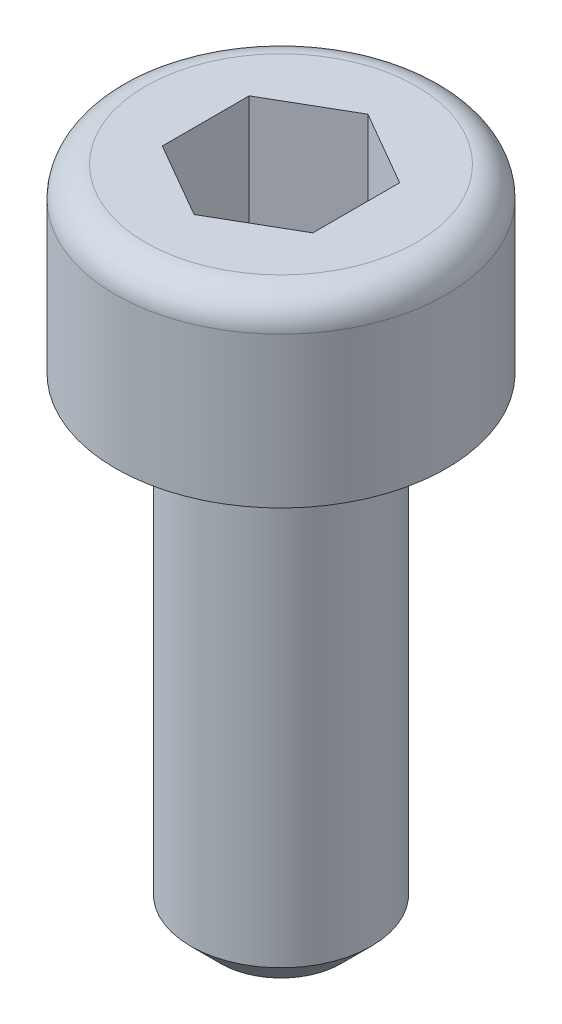
ISO-10303-21;
HEADER;
FILE_DESCRIPTION(('STEP AP214'),'2;1');
FILE_NAME('part.step','',(''),(''),'','','');
FILE_SCHEMA(('AUTOMOTIVE_DESIGN { 1 0 10303 214 1 1 1 1 }'));
ENDSEC;
DATA;
#1=APPLICATION_CONTEXT('core data for automotive mechanical design processes');
#2=APPLICATION_PROTOCOL_DEFINITION('international standard','automotive_design',2000,#1);
#3=PRODUCT_CONTEXT('',#1,'mechanical');
#4=PRODUCT('Part','Part','',(#3));
#5=PRODUCT_RELATED_PRODUCT_CATEGORY('part','',(#4));
#6=PRODUCT_DEFINITION_FORMATION('','',#4);
#7=PRODUCT_DEFINITION_CONTEXT('part definition',#1,'design');
#8=PRODUCT_DEFINITION('design','',#6,#7);
#9=PRODUCT_DEFINITION_SHAPE('','',#8);
#10=(LENGTH_UNIT() NAMED_UNIT(*) SI_UNIT(.MILLI.,.METRE.));
#11=(NAMED_UNIT(*) PLANE_ANGLE_UNIT() SI_UNIT($,.RADIAN.));
#12=(NAMED_UNIT(*) SI_UNIT($,.STERADIAN.) SOLID_ANGLE_UNIT());
#13=UNCERTAINTY_MEASURE_WITH_UNIT(LENGTH_MEASURE(1.E-05),#10,'distance_accuracy_value','');
#14=(GEOMETRIC_REPRESENTATION_CONTEXT(3) GLOBAL_UNCERTAINTY_ASSIGNED_CONTEXT((#13)) GLOBAL_UNIT_ASSIGNED_CONTEXT((#10,
#11,#12)) REPRESENTATION_CONTEXT('',''));
#15=CARTESIAN_POINT('',(0.,0.,0.));
#16=DIRECTION('',(0.,0.,1.));
#17=DIRECTION('',(1.,0.,0.));
#18=AXIS2_PLACEMENT_3D('',#15,#16,#17);
#19=CARTESIAN_POINT('',(0.,0.,0.));
#20=DIRECTION('',(0.,-1.,0.));
#21=DIRECTION('',(0.,0.,-1.));
#22=AXIS2_PLACEMENT_3D('',#19,#20,#21);
#23=PLANE('',#22);
#24=CARTESIAN_POINT('',(0.,0.,0.));
#25=DIRECTION('',(0.,-1.,0.));
#26=DIRECTION('',(0.,0.,-1.));
#27=AXIS2_PLACEMENT_3D('',#24,#25,#26);
#28=CIRCLE('',#27,2.25);
#29=CARTESIAN_POINT('',(0.,0.,-2.25));
#30=VERTEX_POINT('',#29);
#31=EDGE_CURVE('E42',#30,#30,#28,.F.);
#32=ORIENTED_EDGE('',*,*,#31,.T.);
#33=EDGE_LOOP('',(#32));
#34=FACE_BOUND('',#33,.T.);
#35=DIRECTION('',(-0.866025403784439,0.,-0.5));
#36=VECTOR('',#35,1.);
#37=CARTESIAN_POINT('',(1.25,0.,-0.721687836487032));
#38=LINE('',#37,#36);
#39=CARTESIAN_POINT('',(1.25,0.,-0.721687836487032));
#40=VERTEX_POINT('',#39);
#41=CARTESIAN_POINT('',(0.,0.,-1.44337567297406));
#42=VERTEX_POINT('',#41);
#43=EDGE_CURVE('E123',#40,#42,#38,.T.);
#44=ORIENTED_EDGE('',*,*,#43,.F.);
#45=DIRECTION('',(0.,0.,-1.));
#46=VECTOR('',#45,1.);
#47=CARTESIAN_POINT('',(1.25,0.,0.721687836487033));
#48=LINE('',#47,#46);
#49=CARTESIAN_POINT('',(1.25,0.,0.721687836487033));
#50=VERTEX_POINT('',#49);
#51=EDGE_CURVE('E49',#50,#40,#48,.T.);
#52=ORIENTED_EDGE('',*,*,#51,.F.);
#53=DIRECTION('',(0.866025403784439,0.,-0.5));
#54=VECTOR('',#53,1.);
#55=CARTESIAN_POINT('',(0.,0.,1.44337567297406));
#56=LINE('',#55,#54);
#57=CARTESIAN_POINT('',(0.,0.,1.44337567297406));
#58=VERTEX_POINT('',#57);
#59=EDGE_CURVE('E132',#58,#50,#56,.T.);
#60=ORIENTED_EDGE('',*,*,#59,.F.);
#61=DIRECTION('',(0.866025403784439,0.,0.5));
#62=VECTOR('',#61,1.);
#63=CARTESIAN_POINT('',(-1.25,0.,0.721687836487031));
#64=LINE('',#63,#62);
#65=CARTESIAN_POINT('',(-1.25,0.,0.721687836487031));
#66=VERTEX_POINT('',#65);
#67=EDGE_CURVE('E130',#66,#58,#64,.T.);
#68=ORIENTED_EDGE('',*,*,#67,.F.);
#69=DIRECTION('',(0.,0.,1.));
#70=VECTOR('',#69,1.);
#71=CARTESIAN_POINT('',(-1.25,0.,-0.721687836487033));
#72=LINE('',#71,#70);
#73=CARTESIAN_POINT('',(-1.25,0.,-0.721687836487033));
#74=VERTEX_POINT('',#73);
#75=EDGE_CURVE('E97',#74,#66,#72,.T.);
#76=ORIENTED_EDGE('',*,*,#75,.F.);
#77=DIRECTION('',(-0.866025403784439,0.,0.5));
#78=VECTOR('',#77,1.);
#79=CARTESIAN_POINT('',(0.,0.,-1.44337567297406));
#80=LINE('',#79,#78);
#81=EDGE_CURVE('E126',#42,#74,#80,.T.);
#82=ORIENTED_EDGE('',*,*,#81,.F.);
#83=EDGE_LOOP('',(#44,#52,#60,#68,#76,#82));
#84=FACE_BOUND('',#83,.T.);
#85=ADVANCED_FACE('F34',(#34,#84),#23,.F.);
#86=CARTESIAN_POINT('',(0.,0.,0.));
#87=DIRECTION('',(0.,1.,0.));
#88=DIRECTION('',(0.,0.,1.));
#89=AXIS2_PLACEMENT_3D('',#86,#87,#88);
#90=CYLINDRICAL_SURFACE('',#89,2.75);
#91=CARTESIAN_POINT('',(0.,-0.5,0.));
#92=DIRECTION('',(0.,-1.,0.));
#93=DIRECTION('',(0.,0.,-1.));
#94=AXIS2_PLACEMENT_3D('',#91,#92,#93);
#95=CIRCLE('',#94,2.75);
#96=CARTESIAN_POINT('',(0.,-0.5,-2.75));
#97=VERTEX_POINT('',#96);
#98=EDGE_CURVE('E11',#97,#97,#95,.T.);
#99=ORIENTED_EDGE('',*,*,#98,.T.);
#100=EDGE_LOOP('',(#99));
#101=FACE_BOUND('',#100,.T.);
#102=CARTESIAN_POINT('',(0.,-3.,0.));
#103=DIRECTION('',(0.,1.,0.));
#104=DIRECTION('',(0.,0.,1.));
#105=AXIS2_PLACEMENT_3D('',#102,#103,#104);
#106=CIRCLE('',#105,2.75);
#107=CARTESIAN_POINT('',(0.,-3.,2.75));
#108=VERTEX_POINT('',#107);
#109=EDGE_CURVE('E144',#108,#108,#106,.T.);
#110=ORIENTED_EDGE('',*,*,#109,.T.);
#111=EDGE_LOOP('',(#110));
#112=FACE_BOUND('',#111,.T.);
#113=ADVANCED_FACE('F166',(#101,#112),#90,.T.);
#114=CARTESIAN_POINT('',(2.75,-3.,0.));
#115=DIRECTION('',(0.,1.,0.));
#116=DIRECTION('',(0.,0.,1.));
#117=AXIS2_PLACEMENT_3D('',#114,#115,#116);
#118=PLANE('',#117);
#119=ORIENTED_EDGE('',*,*,#109,.F.);
#120=EDGE_LOOP('',(#119));
#121=FACE_BOUND('',#120,.T.);
#122=CARTESIAN_POINT('',(0.,-3.,0.));
#123=DIRECTION('',(0.,1.,0.));
#124=DIRECTION('',(0.,0.,1.));
#125=AXIS2_PLACEMENT_3D('',#122,#123,#124);
#126=CIRCLE('',#125,1.5);
#127=CARTESIAN_POINT('',(0.,-3.,1.5));
#128=VERTEX_POINT('',#127);
#129=EDGE_CURVE('E136',#128,#128,#126,.T.);
#130=ORIENTED_EDGE('',*,*,#129,.T.);
#131=EDGE_LOOP('',(#130));
#132=FACE_BOUND('',#131,.T.);
#133=ADVANCED_FACE('F171',(#121,#132),#118,.F.);
#134=CARTESIAN_POINT('',(0.,0.,0.));
#135=DIRECTION('',(0.,1.,0.));
#136=DIRECTION('',(0.,0.,1.));
#137=AXIS2_PLACEMENT_3D('',#134,#135,#136);
#138=CYLINDRICAL_SURFACE('',#137,1.5);
#139=CARTESIAN_POINT('',(0.,-10.5,0.));
#140=DIRECTION('',(0.,1.,0.));
#141=DIRECTION('',(0.,0.,1.));
#142=AXIS2_PLACEMENT_3D('',#139,#140,#141);
#143=CIRCLE('',#142,1.5);
#144=CARTESIAN_POINT('',(0.,-10.5,1.5));
#145=VERTEX_POINT('',#144);
#146=EDGE_CURVE('E147',#145,#145,#143,.T.);
#147=ORIENTED_EDGE('',*,*,#146,.T.);
#148=EDGE_LOOP('',(#147));
#149=FACE_BOUND('',#148,.T.);
#150=ORIENTED_EDGE('',*,*,#129,.F.);
#151=EDGE_LOOP('',(#150));
#152=FACE_BOUND('',#151,.T.);
#153=ADVANCED_FACE('F177',(#149,#152),#138,.T.);
#154=CARTESIAN_POINT('',(1.5,-11.,0.));
#155=DIRECTION('',(0.,1.,0.));
#156=DIRECTION('',(0.,0.,1.));
#157=AXIS2_PLACEMENT_3D('',#154,#155,#156);
#158=PLANE('',#157);
#159=CARTESIAN_POINT('',(0.,-11.,0.));
#160=DIRECTION('',(0.,1.,0.));
#161=DIRECTION('',(0.,0.,1.));
#162=AXIS2_PLACEMENT_3D('',#159,#160,#161);
#163=CIRCLE('',#162,1.);
#164=CARTESIAN_POINT('',(0.,-11.,1.));
#165=VERTEX_POINT('',#164);
#166=EDGE_CURVE('E150',#165,#165,#163,.F.);
#167=ORIENTED_EDGE('',*,*,#166,.T.);
#168=EDGE_LOOP('',(#167));
#169=FACE_BOUND('',#168,.T.);
#170=ADVANCED_FACE('F181',(#169),#158,.F.);
#171=CARTESIAN_POINT('',(1.25,-2.,0.721687836487033));
#172=DIRECTION('',(1.,0.,0.));
#173=DIRECTION('',(0.,0.,-1.));
#174=AXIS2_PLACEMENT_3D('',#171,#172,#173);
#175=PLANE('',#174);
#176=ORIENTED_EDGE('',*,*,#51,.T.);
#177=DIRECTION('',(0.,1.,0.));
#178=VECTOR('',#177,1.);
#179=CARTESIAN_POINT('',(1.25,-2.,-0.721687836487032));
#180=LINE('',#179,#178);
#181=CARTESIAN_POINT('',(1.25,-2.,-0.721687836487032));
#182=VERTEX_POINT('',#181);
#183=EDGE_CURVE('E79',#182,#40,#180,.T.);
#184=ORIENTED_EDGE('',*,*,#183,.F.);
#185=DIRECTION('',(0.,0.,-1.));
#186=VECTOR('',#185,1.);
#187=CARTESIAN_POINT('',(1.25,-2.,0.721687836487033));
#188=LINE('',#187,#186);
#189=CARTESIAN_POINT('',(1.25,-2.,0.721687836487033));
#190=VERTEX_POINT('',#189);
#191=EDGE_CURVE('E134',#190,#182,#188,.T.);
#192=ORIENTED_EDGE('',*,*,#191,.F.);
#193=DIRECTION('',(0.,1.,0.));
#194=VECTOR('',#193,1.);
#195=CARTESIAN_POINT('',(1.25,-2.,0.721687836487033));
#196=LINE('',#195,#194);
#197=EDGE_CURVE('E57',#190,#50,#196,.T.);
#198=ORIENTED_EDGE('',*,*,#197,.T.);
#199=EDGE_LOOP('',(#176,#184,#192,#198));
#200=FACE_BOUND('',#199,.T.);
#201=ADVANCED_FACE('F185',(#200),#175,.F.);
#202=CARTESIAN_POINT('',(0.,-2.,1.44337567297406));
#203=DIRECTION('',(0.5,0.,0.866025403784439));
#204=DIRECTION('',(0.866025403784439,0.,-0.5));
#205=AXIS2_PLACEMENT_3D('',#202,#203,#204);
#206=PLANE('',#205);
#207=ORIENTED_EDGE('',*,*,#59,.T.);
#208=ORIENTED_EDGE('',*,*,#197,.F.);
#209=DIRECTION('',(0.866025403784439,0.,-0.5));
#210=VECTOR('',#209,1.);
#211=CARTESIAN_POINT('',(0.,-2.,1.44337567297406));
#212=LINE('',#211,#210);
#213=CARTESIAN_POINT('',(0.,-2.,1.44337567297406));
#214=VERTEX_POINT('',#213);
#215=EDGE_CURVE('E109',#214,#190,#212,.T.);
#216=ORIENTED_EDGE('',*,*,#215,.F.);
#217=DIRECTION('',(0.,1.,0.));
#218=VECTOR('',#217,1.);
#219=CARTESIAN_POINT('',(0.,-2.,1.44337567297406));
#220=LINE('',#219,#218);
#221=EDGE_CURVE('E101',#214,#58,#220,.T.);
#222=ORIENTED_EDGE('',*,*,#221,.T.);
#223=EDGE_LOOP('',(#207,#208,#216,#222));
#224=FACE_BOUND('',#223,.T.);
#225=ADVANCED_FACE('F189',(#224),#206,.F.);
#226=CARTESIAN_POINT('',(-1.25,-2.,0.721687836487031));
#227=DIRECTION('',(-0.5,0.,0.866025403784439));
#228=DIRECTION('',(0.866025403784439,0.,0.5));
#229=AXIS2_PLACEMENT_3D('',#226,#227,#228);
#230=PLANE('',#229);
#231=ORIENTED_EDGE('',*,*,#67,.T.);
#232=ORIENTED_EDGE('',*,*,#221,.F.);
#233=DIRECTION('',(0.866025403784439,0.,0.5));
#234=VECTOR('',#233,1.);
#235=CARTESIAN_POINT('',(-1.25,-2.,0.721687836487031));
#236=LINE('',#235,#234);
#237=CARTESIAN_POINT('',(-1.25,-2.,0.721687836487031));
#238=VERTEX_POINT('',#237);
#239=EDGE_CURVE('E105',#238,#214,#236,.T.);
#240=ORIENTED_EDGE('',*,*,#239,.F.);
#241=DIRECTION('',(0.,1.,0.));
#242=VECTOR('',#241,1.);
#243=CARTESIAN_POINT('',(-1.25,-2.,0.721687836487031));
#244=LINE('',#243,#242);
#245=EDGE_CURVE('E90',#238,#66,#244,.T.);
#246=ORIENTED_EDGE('',*,*,#245,.T.);
#247=EDGE_LOOP('',(#231,#232,#240,#246));
#248=FACE_BOUND('',#247,.T.);
#249=ADVANCED_FACE('F106',(#248),#230,.F.);
#250=CARTESIAN_POINT('',(-1.25,-2.,-0.721687836487033));
#251=DIRECTION('',(-1.,0.,0.));
#252=DIRECTION('',(0.,0.,1.));
#253=AXIS2_PLACEMENT_3D('',#250,#251,#252);
#254=PLANE('',#253);
#255=ORIENTED_EDGE('',*,*,#75,.T.);
#256=ORIENTED_EDGE('',*,*,#245,.F.);
#257=DIRECTION('',(0.,0.,1.));
#258=VECTOR('',#257,1.);
#259=CARTESIAN_POINT('',(-1.25,-2.,-0.721687836487033));
#260=LINE('',#259,#258);
#261=CARTESIAN_POINT('',(-1.25,-2.,-0.721687836487033));
#262=VERTEX_POINT('',#261);
#263=EDGE_CURVE('E94',#262,#238,#260,.T.);
#264=ORIENTED_EDGE('',*,*,#263,.F.);
#265=DIRECTION('',(0.,1.,0.));
#266=VECTOR('',#265,1.);
#267=CARTESIAN_POINT('',(-1.25,-2.,-0.721687836487033));
#268=LINE('',#267,#266);
#269=EDGE_CURVE('E102',#262,#74,#268,.T.);
#270=ORIENTED_EDGE('',*,*,#269,.T.);
#271=EDGE_LOOP('',(#255,#256,#264,#270));
#272=FACE_BOUND('',#271,.T.);
#273=ADVANCED_FACE('F92',(#272),#254,.F.);
#274=CARTESIAN_POINT('',(0.,-2.,-1.44337567297406));
#275=DIRECTION('',(-0.5,0.,-0.866025403784439));
#276=DIRECTION('',(-0.866025403784439,0.,0.5));
#277=AXIS2_PLACEMENT_3D('',#274,#275,#276);
#278=PLANE('',#277);
#279=ORIENTED_EDGE('',*,*,#81,.T.);
#280=ORIENTED_EDGE('',*,*,#269,.F.);
#281=DIRECTION('',(-0.866025403784439,0.,0.5));
#282=VECTOR('',#281,1.);
#283=CARTESIAN_POINT('',(0.,-2.,-1.44337567297406));
#284=LINE('',#283,#282);
#285=CARTESIAN_POINT('',(0.,-2.,-1.44337567297406));
#286=VERTEX_POINT('',#285);
#287=EDGE_CURVE('E115',#286,#262,#284,.T.);
#288=ORIENTED_EDGE('',*,*,#287,.F.);
#289=DIRECTION('',(0.,1.,0.));
#290=VECTOR('',#289,1.);
#291=CARTESIAN_POINT('',(0.,-2.,-1.44337567297406));
#292=LINE('',#291,#290);
#293=EDGE_CURVE('E139',#286,#42,#292,.T.);
#294=ORIENTED_EDGE('',*,*,#293,.T.);
#295=EDGE_LOOP('',(#279,#280,#288,#294));
#296=FACE_BOUND('',#295,.T.);
#297=ADVANCED_FACE('F193',(#296),#278,.F.);
#298=CARTESIAN_POINT('',(1.25,-2.,-0.721687836487032));
#299=DIRECTION('',(0.5,0.,-0.866025403784439));
#300=DIRECTION('',(-0.866025403784439,0.,-0.5));
#301=AXIS2_PLACEMENT_3D('',#298,#299,#300);
#302=PLANE('',#301);
#303=ORIENTED_EDGE('',*,*,#43,.T.);
#304=ORIENTED_EDGE('',*,*,#293,.F.);
#305=DIRECTION('',(-0.866025403784439,0.,-0.5));
#306=VECTOR('',#305,1.);
#307=CARTESIAN_POINT('',(1.25,-2.,-0.721687836487032));
#308=LINE('',#307,#306);
#309=EDGE_CURVE('E117',#182,#286,#308,.T.);
#310=ORIENTED_EDGE('',*,*,#309,.F.);
#311=ORIENTED_EDGE('',*,*,#183,.T.);
#312=EDGE_LOOP('',(#303,#304,#310,#311));
#313=FACE_BOUND('',#312,.T.);
#314=ADVANCED_FACE('F190',(#313),#302,.F.);
#315=CARTESIAN_POINT('',(1.25,-2.,-0.721687836487032));
#316=DIRECTION('',(0.,1.,0.));
#317=DIRECTION('',(0.,0.,1.));
#318=AXIS2_PLACEMENT_3D('',#315,#316,#317);
#319=PLANE('',#318);
#320=ORIENTED_EDGE('',*,*,#191,.T.);
#321=ORIENTED_EDGE('',*,*,#309,.T.);
#322=ORIENTED_EDGE('',*,*,#287,.T.);
#323=ORIENTED_EDGE('',*,*,#263,.T.);
#324=ORIENTED_EDGE('',*,*,#239,.T.);
#325=ORIENTED_EDGE('',*,*,#215,.T.);
#326=EDGE_LOOP('',(#320,#321,#322,#323,#324,#325));
#327=FACE_BOUND('',#326,.T.);
#328=ADVANCED_FACE('F112',(#327),#319,.T.);
#329=CARTESIAN_POINT('',(0.,-10.5,0.));
#330=DIRECTION('',(0.,1.,0.));
#331=DIRECTION('',(0.,0.,1.));
#332=AXIS2_PLACEMENT_3D('',#329,#330,#331);
#333=CONICAL_SURFACE('',#332,1.5,0.785398163397449);
#334=ORIENTED_EDGE('',*,*,#166,.F.);
#335=EDGE_LOOP('',(#334));
#336=FACE_BOUND('',#335,.T.);
#337=ORIENTED_EDGE('',*,*,#146,.F.);
#338=EDGE_LOOP('',(#337));
#339=FACE_BOUND('',#338,.T.);
#340=ADVANCED_FACE('F158',(#336,#339),#333,.T.);
#341=CARTESIAN_POINT('',(0.,-0.5,0.));
#342=DIRECTION('',(0.,-1.,0.));
#343=DIRECTION('',(0.,0.,-1.));
#344=AXIS2_PLACEMENT_3D('',#341,#342,#343);
#345=TOROIDAL_SURFACE('',#344,2.25,0.5);
#346=ORIENTED_EDGE('',*,*,#98,.F.);
#347=EDGE_LOOP('',(#346));
#348=FACE_BOUND('',#347,.T.);
#349=ORIENTED_EDGE('',*,*,#31,.F.);
#350=EDGE_LOOP('',(#349));
#351=FACE_BOUND('',#350,.T.);
#352=ADVANCED_FACE('F36',(#348,#351),#345,.T.);
#353=CLOSED_SHELL('',(#85,#113,#133,#153,#170,#201,#225,#249,#273,#297,#314,#328,#340,#352));
#354=MANIFOLD_SOLID_BREP('B2',#353);
#355=ADVANCED_BREP_SHAPE_REPRESENTATION('',(#18,#354),#14);
#356=SHAPE_DEFINITION_REPRESENTATION(#9,#355);
ENDSEC;
END-ISO-10303-21;
